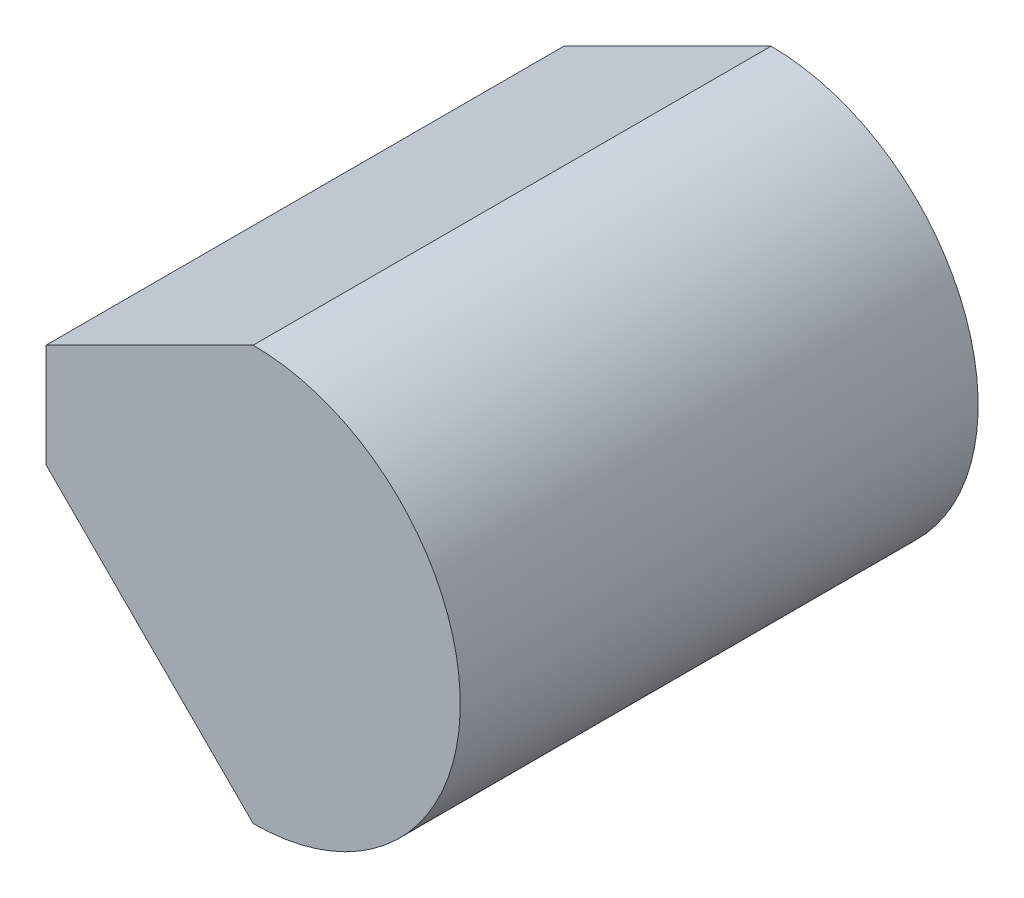
ISO-10303-21;
HEADER;
FILE_DESCRIPTION(('STEP AP214'),'2;1');
FILE_NAME('part.step','',(''),(''),'','','');
FILE_SCHEMA(('AUTOMOTIVE_DESIGN { 1 0 10303 214 1 1 1 1 }'));
ENDSEC;
DATA;
#1=APPLICATION_CONTEXT('core data for automotive mechanical design processes');
#2=APPLICATION_PROTOCOL_DEFINITION('international standard','automotive_design',2000,#1);
#3=PRODUCT_CONTEXT('',#1,'mechanical');
#4=PRODUCT('Part','Part','',(#3));
#5=PRODUCT_RELATED_PRODUCT_CATEGORY('part','',(#4));
#6=PRODUCT_DEFINITION_FORMATION('','',#4);
#7=PRODUCT_DEFINITION_CONTEXT('part definition',#1,'design');
#8=PRODUCT_DEFINITION('design','',#6,#7);
#9=PRODUCT_DEFINITION_SHAPE('','',#8);
#10=(LENGTH_UNIT() NAMED_UNIT(*) SI_UNIT(.MILLI.,.METRE.));
#11=(NAMED_UNIT(*) PLANE_ANGLE_UNIT() SI_UNIT($,.RADIAN.));
#12=(NAMED_UNIT(*) SI_UNIT($,.STERADIAN.) SOLID_ANGLE_UNIT());
#13=UNCERTAINTY_MEASURE_WITH_UNIT(LENGTH_MEASURE(1.E-05),#10,'distance_accuracy_value','');
#14=(GEOMETRIC_REPRESENTATION_CONTEXT(3) GLOBAL_UNCERTAINTY_ASSIGNED_CONTEXT((#13)) GLOBAL_UNIT_ASSIGNED_CONTEXT((#10,
#11,#12)) REPRESENTATION_CONTEXT('',''));
#15=CARTESIAN_POINT('',(0.,0.,0.));
#16=DIRECTION('',(0.,0.,1.));
#17=DIRECTION('',(1.,0.,0.));
#18=AXIS2_PLACEMENT_3D('',#15,#16,#17);
#19=CARTESIAN_POINT('',(-10.,10.,25.));
#20=DIRECTION('',(0.707106781186547,0.707106781186548,0.));
#21=DIRECTION('',(-0.707106781186548,0.707106781186547,0.));
#22=AXIS2_PLACEMENT_3D('',#19,#20,#21);
#23=PLANE('',#22);
#24=DIRECTION('',(0.707106781186548,-0.707106781186547,0.));
#25=VECTOR('',#24,1.);
#26=CARTESIAN_POINT('',(-10.,10.,0.));
#27=LINE('',#26,#25);
#28=CARTESIAN_POINT('',(-10.,10.,0.));
#29=VERTEX_POINT('',#28);
#30=CARTESIAN_POINT('',(0.,0.,0.));
#31=VERTEX_POINT('',#30);
#32=EDGE_CURVE('E96',#29,#31,#27,.T.);
#33=ORIENTED_EDGE('',*,*,#32,.T.);
#34=DIRECTION('',(0.,0.,-1.));
#35=VECTOR('',#34,1.);
#36=CARTESIAN_POINT('',(0.,0.,25.));
#37=LINE('',#36,#35);
#38=CARTESIAN_POINT('',(0.,0.,25.));
#39=VERTEX_POINT('',#38);
#40=EDGE_CURVE('E11',#39,#31,#37,.T.);
#41=ORIENTED_EDGE('',*,*,#40,.F.);
#42=DIRECTION('',(0.707106781186548,-0.707106781186547,0.));
#43=VECTOR('',#42,1.);
#44=CARTESIAN_POINT('',(-10.,10.,25.));
#45=LINE('',#44,#43);
#46=CARTESIAN_POINT('',(-10.,10.,25.));
#47=VERTEX_POINT('',#46);
#48=EDGE_CURVE('E84',#47,#39,#45,.T.);
#49=ORIENTED_EDGE('',*,*,#48,.F.);
#50=DIRECTION('',(0.,0.,-1.));
#51=VECTOR('',#50,1.);
#52=CARTESIAN_POINT('',(-10.,10.,25.));
#53=LINE('',#52,#51);
#54=EDGE_CURVE('E92',#47,#29,#53,.T.);
#55=ORIENTED_EDGE('',*,*,#54,.T.);
#56=EDGE_LOOP('',(#33,#41,#49,#55));
#57=FACE_BOUND('',#56,.T.);
#58=ADVANCED_FACE('F33',(#57),#23,.F.);
#59=CARTESIAN_POINT('',(0.,10.,25.));
#60=DIRECTION('',(0.,0.,-1.));
#61=DIRECTION('',(-1.,0.,0.));
#62=AXIS2_PLACEMENT_3D('',#59,#60,#61);
#63=CYLINDRICAL_SURFACE('',#62,10.);
#64=CARTESIAN_POINT('',(0.,10.,0.));
#65=DIRECTION('',(0.,0.,1.));
#66=DIRECTION('',(1.,0.,0.));
#67=AXIS2_PLACEMENT_3D('',#64,#65,#66);
#68=CIRCLE('',#67,10.);
#69=CARTESIAN_POINT('',(0.,20.,0.));
#70=VERTEX_POINT('',#69);
#71=EDGE_CURVE('E88',#31,#70,#68,.T.);
#72=ORIENTED_EDGE('',*,*,#71,.T.);
#73=DIRECTION('',(0.,0.,-1.));
#74=VECTOR('',#73,1.);
#75=CARTESIAN_POINT('',(0.,20.,25.));
#76=LINE('',#75,#74);
#77=CARTESIAN_POINT('',(0.,20.,25.));
#78=VERTEX_POINT('',#77);
#79=EDGE_CURVE('E41',#78,#70,#76,.T.);
#80=ORIENTED_EDGE('',*,*,#79,.F.);
#81=CARTESIAN_POINT('',(0.,10.,25.));
#82=DIRECTION('',(0.,0.,1.));
#83=DIRECTION('',(1.,0.,0.));
#84=AXIS2_PLACEMENT_3D('',#81,#82,#83);
#85=CIRCLE('',#84,10.);
#86=EDGE_CURVE('E79',#39,#78,#85,.T.);
#87=ORIENTED_EDGE('',*,*,#86,.F.);
#88=ORIENTED_EDGE('',*,*,#40,.T.);
#89=EDGE_LOOP('',(#72,#80,#87,#88));
#90=FACE_BOUND('',#89,.T.);
#91=ADVANCED_FACE('F87',(#90),#63,.T.);
#92=CARTESIAN_POINT('',(-10.,15.,25.));
#93=DIRECTION('',(0.447213595499958,-0.894427190999916,0.));
#94=DIRECTION('',(0.894427190999916,0.447213595499958,0.));
#95=AXIS2_PLACEMENT_3D('',#92,#93,#94);
#96=PLANE('',#95);
#97=DIRECTION('',(-0.894427190999916,-0.447213595499958,0.));
#98=VECTOR('',#97,1.);
#99=CARTESIAN_POINT('',(-10.,15.,0.));
#100=LINE('',#99,#98);
#101=CARTESIAN_POINT('',(-10.,15.,0.));
#102=VERTEX_POINT('',#101);
#103=EDGE_CURVE('E66',#70,#102,#100,.T.);
#104=ORIENTED_EDGE('',*,*,#103,.T.);
#105=DIRECTION('',(0.,0.,-1.));
#106=VECTOR('',#105,1.);
#107=CARTESIAN_POINT('',(-10.,15.,25.));
#108=LINE('',#107,#106);
#109=CARTESIAN_POINT('',(-10.,15.,25.));
#110=VERTEX_POINT('',#109);
#111=EDGE_CURVE('E89',#110,#102,#108,.T.);
#112=ORIENTED_EDGE('',*,*,#111,.F.);
#113=DIRECTION('',(-0.894427190999916,-0.447213595499958,0.));
#114=VECTOR('',#113,1.);
#115=CARTESIAN_POINT('',(-10.,15.,25.));
#116=LINE('',#115,#114);
#117=EDGE_CURVE('E82',#78,#110,#116,.T.);
#118=ORIENTED_EDGE('',*,*,#117,.F.);
#119=ORIENTED_EDGE('',*,*,#79,.T.);
#120=EDGE_LOOP('',(#104,#112,#118,#119));
#121=FACE_BOUND('',#120,.T.);
#122=ADVANCED_FACE('F90',(#121),#96,.F.);
#123=CARTESIAN_POINT('',(-10.,10.,25.));
#124=DIRECTION('',(1.,0.,0.));
#125=DIRECTION('',(0.,0.,-1.));
#126=AXIS2_PLACEMENT_3D('',#123,#124,#125);
#127=PLANE('',#126);
#128=DIRECTION('',(0.,-1.,0.));
#129=VECTOR('',#128,1.);
#130=CARTESIAN_POINT('',(-10.,10.,0.));
#131=LINE('',#130,#129);
#132=EDGE_CURVE('E72',#102,#29,#131,.T.);
#133=ORIENTED_EDGE('',*,*,#132,.T.);
#134=ORIENTED_EDGE('',*,*,#54,.F.);
#135=DIRECTION('',(0.,-1.,0.));
#136=VECTOR('',#135,1.);
#137=CARTESIAN_POINT('',(-10.,10.,25.));
#138=LINE('',#137,#136);
#139=EDGE_CURVE('E49',#110,#47,#138,.T.);
#140=ORIENTED_EDGE('',*,*,#139,.F.);
#141=ORIENTED_EDGE('',*,*,#111,.T.);
#142=EDGE_LOOP('',(#133,#134,#140,#141));
#143=FACE_BOUND('',#142,.T.);
#144=ADVANCED_FACE('F103',(#143),#127,.F.);
#145=CARTESIAN_POINT('',(0.,10.,25.));
#146=DIRECTION('',(0.,0.,1.));
#147=DIRECTION('',(1.,0.,0.));
#148=AXIS2_PLACEMENT_3D('',#145,#146,#147);
#149=PLANE('',#148);
#150=ORIENTED_EDGE('',*,*,#48,.T.);
#151=ORIENTED_EDGE('',*,*,#86,.T.);
#152=ORIENTED_EDGE('',*,*,#117,.T.);
#153=ORIENTED_EDGE('',*,*,#139,.T.);
#154=EDGE_LOOP('',(#150,#151,#152,#153));
#155=FACE_BOUND('',#154,.T.);
#156=ADVANCED_FACE('F80',(#155),#149,.T.);
#157=CARTESIAN_POINT('',(0.,10.,0.));
#158=DIRECTION('',(0.,0.,1.));
#159=DIRECTION('',(1.,0.,0.));
#160=AXIS2_PLACEMENT_3D('',#157,#158,#159);
#161=PLANE('',#160);
#162=ORIENTED_EDGE('',*,*,#32,.F.);
#163=ORIENTED_EDGE('',*,*,#132,.F.);
#164=ORIENTED_EDGE('',*,*,#103,.F.);
#165=ORIENTED_EDGE('',*,*,#71,.F.);
#166=EDGE_LOOP('',(#162,#163,#164,#165));
#167=FACE_BOUND('',#166,.T.);
#168=ADVANCED_FACE('F106',(#167),#161,.F.);
#169=CLOSED_SHELL('',(#58,#91,#122,#144,#156,#168));
#170=MANIFOLD_SOLID_BREP('B2',#169);
#171=ADVANCED_BREP_SHAPE_REPRESENTATION('',(#18,#170),#14);
#172=SHAPE_DEFINITION_REPRESENTATION(#9,#171);
ENDSEC;
END-ISO-10303-21;
